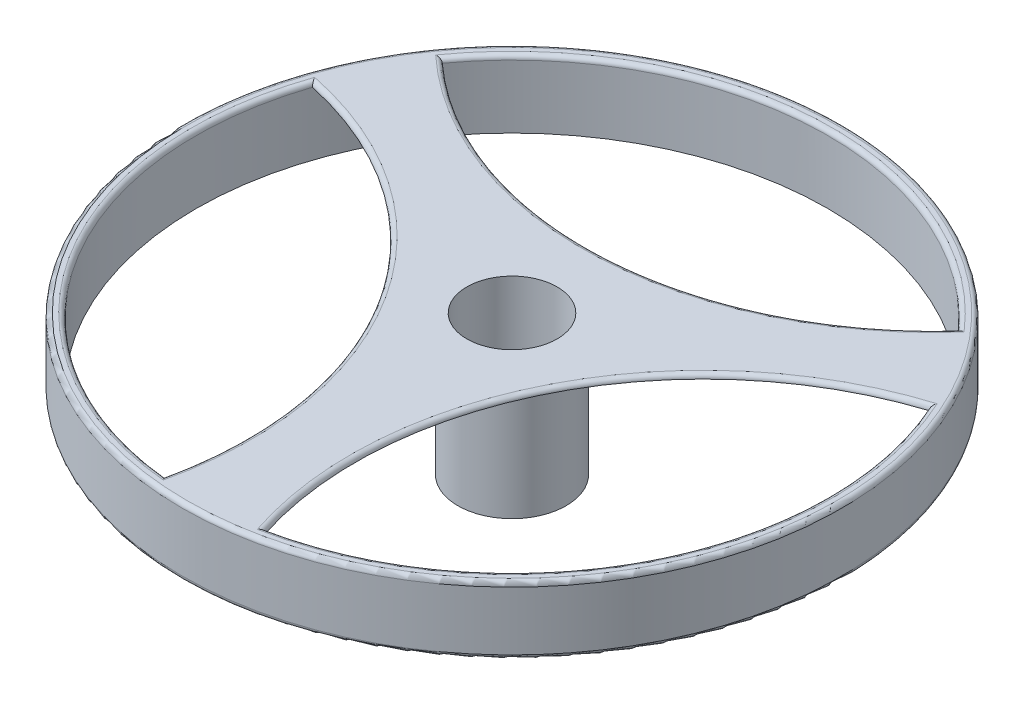
ISO-10303-21;
HEADER;
FILE_DESCRIPTION(('STEP AP214'),'2;1');
FILE_NAME('part.step','',(''),(''),'','','');
FILE_SCHEMA(('AUTOMOTIVE_DESIGN { 1 0 10303 214 1 1 1 1 }'));
ENDSEC;
DATA;
#1=APPLICATION_CONTEXT('core data for automotive mechanical design processes');
#2=APPLICATION_PROTOCOL_DEFINITION('international standard','automotive_design',2000,#1);
#3=PRODUCT_CONTEXT('',#1,'mechanical');
#4=PRODUCT('Part','Part','',(#3));
#5=PRODUCT_RELATED_PRODUCT_CATEGORY('part','',(#4));
#6=PRODUCT_DEFINITION_FORMATION('','',#4);
#7=PRODUCT_DEFINITION_CONTEXT('part definition',#1,'design');
#8=PRODUCT_DEFINITION('design','',#6,#7);
#9=PRODUCT_DEFINITION_SHAPE('','',#8);
#10=(LENGTH_UNIT() NAMED_UNIT(*) SI_UNIT(.MILLI.,.METRE.));
#11=(NAMED_UNIT(*) PLANE_ANGLE_UNIT() SI_UNIT($,.RADIAN.));
#12=(NAMED_UNIT(*) SI_UNIT($,.STERADIAN.) SOLID_ANGLE_UNIT());
#13=UNCERTAINTY_MEASURE_WITH_UNIT(LENGTH_MEASURE(1.E-05),#10,'distance_accuracy_value','');
#14=(GEOMETRIC_REPRESENTATION_CONTEXT(3) GLOBAL_UNCERTAINTY_ASSIGNED_CONTEXT((#13)) GLOBAL_UNIT_ASSIGNED_CONTEXT((#10,
#11,#12)) REPRESENTATION_CONTEXT('',''));
#15=CARTESIAN_POINT('',(0.,0.,0.));
#16=DIRECTION('',(0.,0.,1.));
#17=DIRECTION('',(1.,0.,0.));
#18=AXIS2_PLACEMENT_3D('',#15,#16,#17);
#19=CARTESIAN_POINT('',(0.,1.4,0.));
#20=DIRECTION('',(0.,-1.,0.));
#21=DIRECTION('',(0.,0.,-1.));
#22=AXIS2_PLACEMENT_3D('',#19,#20,#21);
#23=PLANE('',#22);
#24=CARTESIAN_POINT('',(8.7490481961673,1.4,4.505617403492));
#25=DIRECTION('',(0.,-1.,0.));
#26=DIRECTION('',(0.,0.,-1.));
#27=AXIS2_PLACEMENT_3D('',#24,#25,#26);
#28=CIRCLE('',#27,7.71814199906985);
#29=CARTESIAN_POINT('',(6.39577105395077,1.4,-2.84501539986086));
#30=VERTEX_POINT('',#29);
#31=CARTESIAN_POINT('',(1.39841539281421,1.4,6.85889454570781));
#32=VERTEX_POINT('',#31);
#33=EDGE_CURVE('E249',#30,#32,#28,.F.);
#34=ORIENTED_EDGE('',*,*,#33,.T.);
#35=CARTESIAN_POINT('',(0.,1.4,0.));
#36=DIRECTION('',(0.,-1.,0.));
#37=DIRECTION('',(0.,0.,-1.));
#38=AXIS2_PLACEMENT_3D('',#35,#36,#37);
#39=CIRCLE('',#38,7.);
#40=CARTESIAN_POINT('',(-0.734029916537966,1.4,6.96140790944097));
#41=VERTEX_POINT('',#40);
#42=EDGE_CURVE('E120',#32,#41,#39,.T.);
#43=ORIENTED_EDGE('',*,*,#42,.T.);
#44=CARTESIAN_POINT('',(-8.27650322924103,1.4,5.32408929506927));
#45=DIRECTION('',(0.,-1.,0.));
#46=DIRECTION('',(0.,0.,-1.));
#47=AXIS2_PLACEMENT_3D('',#44,#45,#46);
#48=CIRCLE('',#47,7.71814199906985);
#49=CARTESIAN_POINT('',(-6.63918461486858,1.4,-2.21838401763363));
#50=VERTEX_POINT('',#49);
#51=EDGE_CURVE('E109',#41,#50,#48,.F.);
#52=ORIENTED_EDGE('',*,*,#51,.T.);
#53=CARTESIAN_POINT('',(-5.6617411374128,1.4,-4.11639250958016));
#54=VERTEX_POINT('',#53);
#55=EDGE_CURVE('E104',#50,#54,#39,.T.);
#56=ORIENTED_EDGE('',*,*,#55,.T.);
#57=CARTESIAN_POINT('',(-0.472544966926212,1.4,-9.8297066985613));
#58=DIRECTION('',(0.,-1.,0.));
#59=DIRECTION('',(0.,0.,-1.));
#60=AXIS2_PLACEMENT_3D('',#57,#58,#59);
#61=CIRCLE('',#60,7.71814199906985);
#62=CARTESIAN_POINT('',(5.24076922205442,1.4,-4.64051052807416));
#63=VERTEX_POINT('',#62);
#64=EDGE_CURVE('E99',#54,#63,#61,.F.);
#65=ORIENTED_EDGE('',*,*,#64,.T.);
#66=EDGE_CURVE('E102',#63,#30,#39,.T.);
#67=ORIENTED_EDGE('',*,*,#66,.T.);
#68=EDGE_LOOP('',(#34,#43,#52,#56,#65,#67));
#69=FACE_BOUND('',#68,.T.);
#70=CARTESIAN_POINT('',(0.,1.4,0.));
#71=DIRECTION('',(0.,-1.,0.));
#72=DIRECTION('',(0.,0.,-1.));
#73=AXIS2_PLACEMENT_3D('',#70,#71,#72);
#74=CIRCLE('',#73,1.2);
#75=CARTESIAN_POINT('',(0.,1.4,-1.2));
#76=VERTEX_POINT('',#75);
#77=EDGE_CURVE('E253',#76,#76,#74,.T.);
#78=ORIENTED_EDGE('',*,*,#77,.F.);
#79=EDGE_LOOP('',(#78));
#80=FACE_BOUND('',#79,.T.);
#81=ADVANCED_FACE('F37',(#69,#80),#23,.T.);
#82=CARTESIAN_POINT('',(0.,0.,0.));
#83=DIRECTION('',(0.,1.,0.));
#84=DIRECTION('',(0.,0.,1.));
#85=AXIS2_PLACEMENT_3D('',#82,#83,#84);
#86=CYLINDRICAL_SURFACE('',#85,1.);
#87=CARTESIAN_POINT('',(0.,1.5,0.));
#88=DIRECTION('',(0.,1.,0.));
#89=DIRECTION('',(0.,0.,1.));
#90=AXIS2_PLACEMENT_3D('',#87,#88,#89);
#91=CIRCLE('',#90,1.);
#92=CARTESIAN_POINT('',(0.,1.5,1.));
#93=VERTEX_POINT('',#92);
#94=EDGE_CURVE('E136',#93,#93,#91,.T.);
#95=ORIENTED_EDGE('',*,*,#94,.T.);
#96=EDGE_LOOP('',(#95));
#97=FACE_BOUND('',#96,.T.);
#98=CARTESIAN_POINT('',(0.,-1.6,0.));
#99=DIRECTION('',(0.,-1.,0.));
#100=DIRECTION('',(0.,0.,-1.));
#101=AXIS2_PLACEMENT_3D('',#98,#99,#100);
#102=CIRCLE('',#101,1.);
#103=CARTESIAN_POINT('',(0.,-1.6,-1.));
#104=VERTEX_POINT('',#103);
#105=EDGE_CURVE('E257',#104,#104,#102,.T.);
#106=ORIENTED_EDGE('',*,*,#105,.T.);
#107=EDGE_LOOP('',(#106));
#108=FACE_BOUND('',#107,.T.);
#109=ADVANCED_FACE('F216',(#97,#108),#86,.F.);
#110=CARTESIAN_POINT('',(0.,1.5,0.));
#111=DIRECTION('',(0.,-1.,0.));
#112=DIRECTION('',(0.,0.,-1.));
#113=AXIS2_PLACEMENT_3D('',#110,#111,#112);
#114=CYLINDRICAL_SURFACE('',#113,7.3);
#115=CARTESIAN_POINT('',(0.,0.1,0.));
#116=DIRECTION('',(0.,1.,0.));
#117=DIRECTION('',(0.,0.,1.));
#118=AXIS2_PLACEMENT_3D('',#115,#116,#117);
#119=CIRCLE('',#118,7.3);
#120=CARTESIAN_POINT('',(0.,0.1,7.3));
#121=VERTEX_POINT('',#120);
#122=EDGE_CURVE('E51',#121,#121,#119,.T.);
#123=ORIENTED_EDGE('',*,*,#122,.T.);
#124=EDGE_LOOP('',(#123));
#125=FACE_BOUND('',#124,.T.);
#126=CARTESIAN_POINT('',(0.,1.4,0.));
#127=DIRECTION('',(0.,1.,0.));
#128=DIRECTION('',(0.,0.,1.));
#129=AXIS2_PLACEMENT_3D('',#126,#127,#128);
#130=CIRCLE('',#129,7.3);
#131=CARTESIAN_POINT('',(0.,1.4,7.3));
#132=VERTEX_POINT('',#131);
#133=EDGE_CURVE('E156',#132,#132,#130,.F.);
#134=ORIENTED_EDGE('',*,*,#133,.T.);
#135=EDGE_LOOP('',(#134));
#136=FACE_BOUND('',#135,.T.);
#137=ADVANCED_FACE('F221',(#125,#136),#114,.T.);
#138=CARTESIAN_POINT('',(0.,1.5,0.));
#139=DIRECTION('',(0.,1.,0.));
#140=DIRECTION('',(0.,0.,1.));
#141=AXIS2_PLACEMENT_3D('',#138,#139,#140);
#142=PLANE('',#141);
#143=CARTESIAN_POINT('',(-8.27650322924103,1.5,5.32408929506927));
#144=DIRECTION('',(0.,1.,0.));
#145=DIRECTION('',(0.,0.,1.));
#146=AXIS2_PLACEMENT_3D('',#143,#144,#145);
#147=CIRCLE('',#146,7.81814199906985);
#148=CARTESIAN_POINT('',(-6.70522037985575,1.5,-2.33452771617027));
#149=VERTEX_POINT('',#148);
#150=CARTESIAN_POINT('',(-0.655719657964701,1.5,7.069655700963));
#151=VERTEX_POINT('',#150);
#152=EDGE_CURVE('E58',#149,#151,#147,.F.);
#153=ORIENTED_EDGE('',*,*,#152,.T.);
#154=CARTESIAN_POINT('',(0.,1.5,0.));
#155=DIRECTION('',(0.,1.,0.));
#156=DIRECTION('',(0.,0.,1.));
#157=AXIS2_PLACEMENT_3D('',#154,#155,#156);
#158=CIRCLE('',#157,7.1);
#159=EDGE_CURVE('E154',#151,#149,#158,.F.);
#160=ORIENTED_EDGE('',*,*,#159,.T.);
#161=EDGE_LOOP('',(#153,#160));
#162=FACE_BOUND('',#161,.T.);
#163=CARTESIAN_POINT('',(8.7490481961673,1.5,4.505617403492));
#164=DIRECTION('',(0.,1.,0.));
#165=DIRECTION('',(0.,0.,1.));
#166=AXIS2_PLACEMENT_3D('',#163,#164,#165);
#167=CIRCLE('',#166,7.81814199906985);
#168=CARTESIAN_POINT('',(1.33084988188559,1.5,6.97415504501335));
#169=VERTEX_POINT('',#168);
#170=CARTESIAN_POINT('',(6.45036126202578,1.5,-2.96695796892326));
#171=VERTEX_POINT('',#170);
#172=EDGE_CURVE('E148',#169,#171,#167,.F.);
#173=ORIENTED_EDGE('',*,*,#172,.T.);
#174=CARTESIAN_POINT('',(0.,1.5,0.));
#175=DIRECTION('',(0.,1.,0.));
#176=DIRECTION('',(0.,0.,1.));
#177=AXIS2_PLACEMENT_3D('',#174,#175,#176);
#178=CIRCLE('',#177,7.1);
#179=EDGE_CURVE('E150',#171,#169,#178,.F.);
#180=ORIENTED_EDGE('',*,*,#179,.T.);
#181=EDGE_LOOP('',(#173,#180));
#182=FACE_BOUND('',#181,.T.);
#183=CARTESIAN_POINT('',(-0.472544966926212,1.5,-9.8297066985613));
#184=DIRECTION('',(0.,1.,0.));
#185=DIRECTION('',(0.,0.,1.));
#186=AXIS2_PLACEMENT_3D('',#183,#184,#185);
#187=CIRCLE('',#186,7.81814199906985);
#188=CARTESIAN_POINT('',(5.37437049797021,1.5,-4.63962732884306));
#189=VERTEX_POINT('',#188);
#190=CARTESIAN_POINT('',(-5.79464160406107,1.5,-4.1026977320398));
#191=VERTEX_POINT('',#190);
#192=EDGE_CURVE('E124',#189,#191,#187,.F.);
#193=ORIENTED_EDGE('',*,*,#192,.T.);
#194=CARTESIAN_POINT('',(0.,1.5,0.));
#195=DIRECTION('',(0.,1.,0.));
#196=DIRECTION('',(0.,0.,1.));
#197=AXIS2_PLACEMENT_3D('',#194,#195,#196);
#198=CIRCLE('',#197,7.1);
#199=EDGE_CURVE('E146',#191,#189,#198,.F.);
#200=ORIENTED_EDGE('',*,*,#199,.T.);
#201=EDGE_LOOP('',(#193,#200));
#202=FACE_BOUND('',#201,.T.);
#203=CARTESIAN_POINT('',(0.,1.5,0.));
#204=DIRECTION('',(0.,1.,0.));
#205=DIRECTION('',(0.,0.,1.));
#206=AXIS2_PLACEMENT_3D('',#203,#204,#205);
#207=CIRCLE('',#206,7.2);
#208=CARTESIAN_POINT('',(0.,1.5,7.2));
#209=VERTEX_POINT('',#208);
#210=EDGE_CURVE('E142',#209,#209,#207,.T.);
#211=ORIENTED_EDGE('',*,*,#210,.T.);
#212=EDGE_LOOP('',(#211));
#213=FACE_BOUND('',#212,.T.);
#214=ORIENTED_EDGE('',*,*,#94,.F.);
#215=EDGE_LOOP('',(#214));
#216=FACE_BOUND('',#215,.T.);
#217=ADVANCED_FACE('F231',(#162,#182,#202,#213,#216),#142,.T.);
#218=CARTESIAN_POINT('',(0.,0.,0.));
#219=DIRECTION('',(0.,1.,0.));
#220=DIRECTION('',(0.,0.,1.));
#221=AXIS2_PLACEMENT_3D('',#218,#219,#220);
#222=PLANE('',#221);
#223=CARTESIAN_POINT('',(0.,0.,0.));
#224=DIRECTION('',(0.,1.,0.));
#225=DIRECTION('',(0.,0.,1.));
#226=AXIS2_PLACEMENT_3D('',#223,#224,#225);
#227=CIRCLE('',#226,7.2);
#228=CARTESIAN_POINT('',(0.,0.,7.2));
#229=VERTEX_POINT('',#228);
#230=EDGE_CURVE('E11',#229,#229,#227,.F.);
#231=ORIENTED_EDGE('',*,*,#230,.T.);
#232=EDGE_LOOP('',(#231));
#233=FACE_BOUND('',#232,.T.);
#234=CARTESIAN_POINT('',(0.,0.,0.));
#235=DIRECTION('',(0.,1.,0.));
#236=DIRECTION('',(0.,0.,1.));
#237=AXIS2_PLACEMENT_3D('',#234,#235,#236);
#238=CIRCLE('',#237,7.);
#239=CARTESIAN_POINT('',(0.,0.,7.));
#240=VERTEX_POINT('',#239);
#241=EDGE_CURVE('E131',#240,#240,#238,.T.);
#242=ORIENTED_EDGE('',*,*,#241,.T.);
#243=EDGE_LOOP('',(#242));
#244=FACE_BOUND('',#243,.T.);
#245=ADVANCED_FACE('F230',(#233,#244),#222,.F.);
#246=CARTESIAN_POINT('',(0.,0.,0.));
#247=DIRECTION('',(0.,1.,0.));
#248=DIRECTION('',(0.,0.,1.));
#249=AXIS2_PLACEMENT_3D('',#246,#247,#248);
#250=CYLINDRICAL_SURFACE('',#249,7.);
#251=ORIENTED_EDGE('',*,*,#55,.F.);
#252=CARTESIAN_POINT('',(0.,1.4,0.));
#253=DIRECTION('',(0.,1.,0.));
#254=DIRECTION('',(0.,0.,1.));
#255=AXIS2_PLACEMENT_3D('',#252,#253,#254);
#256=CIRCLE('',#255,7.);
#257=EDGE_CURVE('E133',#50,#41,#256,.T.);
#258=ORIENTED_EDGE('',*,*,#257,.T.);
#259=ORIENTED_EDGE('',*,*,#42,.F.);
#260=CARTESIAN_POINT('',(0.,1.4,0.));
#261=DIRECTION('',(0.,1.,0.));
#262=DIRECTION('',(0.,0.,1.));
#263=AXIS2_PLACEMENT_3D('',#260,#261,#262);
#264=CIRCLE('',#263,7.);
#265=EDGE_CURVE('E119',#32,#30,#264,.T.);
#266=ORIENTED_EDGE('',*,*,#265,.T.);
#267=ORIENTED_EDGE('',*,*,#66,.F.);
#268=CARTESIAN_POINT('',(0.,1.4,0.));
#269=DIRECTION('',(0.,1.,0.));
#270=DIRECTION('',(0.,0.,1.));
#271=AXIS2_PLACEMENT_3D('',#268,#269,#270);
#272=CIRCLE('',#271,7.);
#273=EDGE_CURVE('E116',#63,#54,#272,.T.);
#274=ORIENTED_EDGE('',*,*,#273,.T.);
#275=EDGE_LOOP('',(#251,#258,#259,#266,#267,#274));
#276=FACE_BOUND('',#275,.T.);
#277=ORIENTED_EDGE('',*,*,#241,.F.);
#278=EDGE_LOOP('',(#277));
#279=FACE_BOUND('',#278,.T.);
#280=ADVANCED_FACE('F113',(#276,#279),#250,.F.);
#281=CARTESIAN_POINT('',(0.,-1.6,0.));
#282=DIRECTION('',(0.,-1.,0.));
#283=DIRECTION('',(0.,0.,-1.));
#284=AXIS2_PLACEMENT_3D('',#281,#282,#283);
#285=PLANE('',#284);
#286=CARTESIAN_POINT('',(0.,-1.6,0.));
#287=DIRECTION('',(0.,-1.,0.));
#288=DIRECTION('',(0.,0.,-1.));
#289=AXIS2_PLACEMENT_3D('',#286,#287,#288);
#290=CIRCLE('',#289,1.2);
#291=CARTESIAN_POINT('',(0.,-1.6,-1.2));
#292=VERTEX_POINT('',#291);
#293=EDGE_CURVE('E256',#292,#292,#290,.T.);
#294=ORIENTED_EDGE('',*,*,#293,.T.);
#295=EDGE_LOOP('',(#294));
#296=FACE_BOUND('',#295,.T.);
#297=ORIENTED_EDGE('',*,*,#105,.F.);
#298=EDGE_LOOP('',(#297));
#299=FACE_BOUND('',#298,.T.);
#300=ADVANCED_FACE('F229',(#296,#299),#285,.T.);
#301=CARTESIAN_POINT('',(0.,-1.6,0.));
#302=DIRECTION('',(0.,1.,0.));
#303=DIRECTION('',(0.,0.,1.));
#304=AXIS2_PLACEMENT_3D('',#301,#302,#303);
#305=CYLINDRICAL_SURFACE('',#304,1.2);
#306=ORIENTED_EDGE('',*,*,#293,.F.);
#307=EDGE_LOOP('',(#306));
#308=FACE_BOUND('',#307,.T.);
#309=ORIENTED_EDGE('',*,*,#77,.T.);
#310=EDGE_LOOP('',(#309));
#311=FACE_BOUND('',#310,.T.);
#312=ADVANCED_FACE('F180',(#308,#311),#305,.T.);
#313=CARTESIAN_POINT('',(-8.27650322924103,1.4,5.32408929506927));
#314=DIRECTION('',(0.,1.,0.));
#315=DIRECTION('',(0.,0.,1.));
#316=AXIS2_PLACEMENT_3D('',#313,#314,#315);
#317=TOROIDAL_SURFACE('',#316,7.81814199906985,0.1);
#318=CARTESIAN_POINT('',(-0.734029916537966,1.4,6.96140790944097));
#319=CARTESIAN_POINT('',(-0.734035805507698,1.40463053314781,6.96139975681462));
#320=CARTESIAN_POINT('',(-0.733777213389451,1.40925097168651,6.96175743483708));
#321=CARTESIAN_POINT('',(-0.732781692029903,1.41830394607141,6.96313437289628));
#322=CARTESIAN_POINT('',(-0.732048464343124,1.422737655555,6.9641485133585));
#323=CARTESIAN_POINT('',(-0.730155083628527,1.43131510764904,6.96676721064232));
#324=CARTESIAN_POINT('',(-0.728995906530069,1.43545948753824,6.96837041780185));
#325=CARTESIAN_POINT('',(-0.726317307842241,1.4433995617776,6.97207493382507));
#326=CARTESIAN_POINT('',(-0.724797175319223,1.4471945472303,6.9741772256785));
#327=CARTESIAN_POINT('',(-0.72086347634794,1.45568350886513,6.9796171596112));
#328=CARTESIAN_POINT('',(-0.718325277814005,1.46020933762823,6.98312707773416));
#329=CARTESIAN_POINT('',(-0.712853366509015,1.46850024181652,6.99069331304142));
#330=CARTESIAN_POINT('',(-0.709918957263544,1.47226394775385,6.99475059238747));
#331=CARTESIAN_POINT('',(-0.702796592698557,1.48011395067078,7.00459761696339));
#332=CARTESIAN_POINT('',(-0.698505332002009,1.48392705363916,7.01052995892078));
#333=CARTESIAN_POINT('',(-0.689620626594907,1.49032065238917,7.02281105168564));
#334=CARTESIAN_POINT('',(-0.685026961129807,1.4929002360953,7.029160106682));
#335=CARTESIAN_POINT('',(-0.676513694248512,1.49652204862426,7.04092525899367));
#336=CARTESIAN_POINT('',(-0.672621601246672,1.49775742603372,7.04630357215429));
#337=CARTESIAN_POINT('',(-0.664785303869147,1.49945170680195,7.05713121768677));
#338=CARTESIAN_POINT('',(-0.660841215609092,1.49991211613227,7.06258039153196));
#339=CARTESIAN_POINT('',(-0.656504924415274,1.49999619082466,7.0685708867098));
#340=CARTESIAN_POINT('',(-0.656112274042096,1.49999999758367,7.06911332000601));
#341=CARTESIAN_POINT('',(-0.655719657964701,1.5,7.069655700963));
#342=B_SPLINE_CURVE_WITH_KNOTS('',3,(#318,#319,#320,#321,#322,#323,#324,#325,#326,#327,#328,
#329,#330,#331,#332,#333,#334,#335,#336,#337,#338,#339,#340,#341),.UNSPECIFIED.,.F.,.F.,(4,2,2,
2,2,2,2,2,2,2,2,4),(0.,0.0138546088474856,0.027602450263886,0.0413189872455591,
0.0550627675880559,0.0737539637565457,0.0924784544891803,0.117113543402878,0.141766819669725,
0.161982375803211,0.182158602122732,0.184167482379803),.UNSPECIFIED.);
#343=EDGE_CURVE('E161',#151,#41,#342,.F.);
#344=ORIENTED_EDGE('',*,*,#343,.F.);
#345=ORIENTED_EDGE('',*,*,#152,.F.);
#346=CARTESIAN_POINT('',(-6.63918461486858,1.4,-2.21838401763363));
#347=CARTESIAN_POINT('',(-6.63917963771789,1.40463053314781,-2.2183752784545));
#348=CARTESIAN_POINT('',(-6.63939790485594,1.40925097168651,-2.21875889663423));
#349=CARTESIAN_POINT('',(-6.64023814619093,1.41830394607141,-2.22023572285798));
#350=CARTESIAN_POINT('',(-6.64085699634794,1.422737655555,-2.22132343982528));
#351=CARTESIAN_POINT('',(-6.64245495980509,1.43131510764904,-2.22413217241922));
#352=CARTESIAN_POINT('',(-6.64343324956165,1.43545948753824,-2.22585174035745));
#353=CARTESIAN_POINT('',(-6.64569373371466,1.4433995617776,-2.2298252201033));
#354=CARTESIAN_POINT('',(-6.64697652785789,1.4471945472303,-2.2320801864247));
#355=CARTESIAN_POINT('',(-6.65029584099204,1.45568350886513,-2.23791534101616));
#356=CARTESIAN_POINT('',(-6.65243745507213,1.46020933762823,-2.24168037304252));
#357=CARTESIAN_POINT('',(-6.65705391460081,1.46850024181652,-2.24979690133204));
#358=CARTESIAN_POINT('',(-6.65952934683794,1.47226394775385,-2.25414943031543));
#359=CARTESIAN_POINT('',(-6.6655369983754,1.48011395067078,-2.26471352483411));
#360=CARTESIAN_POINT('',(-6.66915614726598,1.48392705363916,-2.27107822127408));
#361=CARTESIAN_POINT('',(-6.67664808277139,1.49032065238917,-2.28425525174581));
#362=CARTESIAN_POINT('',(-6.68052105466681,1.4929002360953,-2.29106791278606));
#363=CARTESIAN_POINT('',(-6.6876974936591,1.49652204862426,-2.30369301655984));
#364=CARTESIAN_POINT('',(-6.69097798296753,1.49775742603372,-2.30946476068844));
#365=CARTESIAN_POINT('',(-6.69758198217171,1.49945170680195,-2.32108511605638));
#366=CARTESIAN_POINT('',(-6.70090539595311,1.49991211613227,-2.32693355590268));
#367=CARTESIAN_POINT('',(-6.70455879333616,1.49999619082466,-2.33336334138548));
#368=CARTESIAN_POINT('',(-6.70488960330026,1.49999999758367,-2.33394555523283));
#369=CARTESIAN_POINT('',(-6.70522037985575,1.5,-2.33452771617027));
#370=B_SPLINE_CURVE_WITH_KNOTS('',3,(#346,#347,#348,#349,#350,#351,#352,#353,#354,#355,#356,
#357,#358,#359,#360,#361,#362,#363,#364,#365,#366,#367,#368,#369),.UNSPECIFIED.,.F.,.F.,(4,2,2,
2,2,2,2,2,2,2,2,4),(0.,0.0138546088474856,0.0276024502638864,0.041318987245559,
0.0550627675880563,0.0737539637565469,0.0924784544891809,0.117113543402879,0.141766819669725,
0.161982375803211,0.182158602122732,0.184167482379803),.UNSPECIFIED.);
#371=EDGE_CURVE('E65',#50,#149,#370,.T.);
#372=ORIENTED_EDGE('',*,*,#371,.F.);
#373=ORIENTED_EDGE('',*,*,#51,.F.);
#374=EDGE_LOOP('',(#344,#345,#372,#373));
#375=FACE_BOUND('',#374,.T.);
#376=ADVANCED_FACE('F176',(#375),#317,.T.);
#377=CARTESIAN_POINT('',(0.,1.4,0.));
#378=DIRECTION('',(0.,1.,0.));
#379=DIRECTION('',(0.,0.,1.));
#380=AXIS2_PLACEMENT_3D('',#377,#378,#379);
#381=TOROIDAL_SURFACE('',#380,7.1,0.1);
#382=ORIENTED_EDGE('',*,*,#371,.T.);
#383=ORIENTED_EDGE('',*,*,#159,.F.);
#384=ORIENTED_EDGE('',*,*,#343,.T.);
#385=ORIENTED_EDGE('',*,*,#257,.F.);
#386=EDGE_LOOP('',(#382,#383,#384,#385));
#387=FACE_BOUND('',#386,.T.);
#388=ADVANCED_FACE('F173',(#387),#381,.T.);
#389=CARTESIAN_POINT('',(8.7490481961673,1.4,4.505617403492));
#390=DIRECTION('',(0.,1.,0.));
#391=DIRECTION('',(0.,0.,1.));
#392=AXIS2_PLACEMENT_3D('',#389,#390,#391);
#393=TOROIDAL_SURFACE('',#392,7.81814199906985,0.1);
#394=CARTESIAN_POINT('',(6.39577105395077,1.4,-2.84501539986086));
#395=CARTESIAN_POINT('',(6.39576693805411,1.40463053314781,-2.8450062235503));
#396=CARTESIAN_POINT('',(6.39594740024882,1.40925097168651,-2.84540900990515));
#397=CARTESIAN_POINT('',(6.39664210290774,1.41830394607141,-2.84695962572213));
#398=CARTESIAN_POINT('',(6.39715376046764,1.422737655555,-2.84810168975675));
#399=CARTESIAN_POINT('',(6.39847492848295,1.43131510764904,-2.85105075419653));
#400=CARTESIAN_POINT('',(6.3992837580614,1.43545948753824,-2.85285623459105));
#401=CARTESIAN_POINT('',(6.40115266370233,1.44339956177759,-2.85702822711287));
#402=CARTESIAN_POINT('',(6.40221323559206,1.4471945472303,-2.85939584642163));
#403=CARTESIAN_POINT('',(6.40495750708704,1.45568350886513,-2.86552249662795));
#404=CARTESIAN_POINT('',(6.40672808607976,1.46020933762823,-2.86947560009967));
#405=CARTESIAN_POINT('',(6.41054468241436,1.46850024181652,-2.87799753195067));
#406=CARTESIAN_POINT('',(6.41259118477556,1.47226394775385,-2.88256744457538));
#407=CARTESIAN_POINT('',(6.4175577759275,1.48011395067078,-2.89365910551163));
#408=CARTESIAN_POINT('',(6.42054970441826,1.48392705363916,-2.9003416172678));
#409=CARTESIAN_POINT('',(6.42674309003532,1.49032065238917,-2.91417654423792));
#410=CARTESIAN_POINT('',(6.42994470021964,1.4929002360953,-2.92132930272536));
#411=CARTESIAN_POINT('',(6.43587698756029,1.49652204862426,-2.9345845842696));
#412=CARTESIAN_POINT('',(6.43858869688597,1.49775742603372,-2.94064439226339));
#413=CARTESIAN_POINT('',(6.44404756429151,1.49945170680195,-2.95284464763018));
#414=CARTESIAN_POINT('',(6.44679464314106,1.49991211613227,-2.95898491518075));
#415=CARTESIAN_POINT('',(6.4498144185494,1.49999619082466,-2.96573550110172));
#416=CARTESIAN_POINT('',(6.45008785437719,1.49999999758367,-2.9663467629478));
#417=CARTESIAN_POINT('',(6.45036126202578,1.5,-2.96695796892326));
#418=B_SPLINE_CURVE_WITH_KNOTS('',3,(#394,#395,#396,#397,#398,#399,#400,#401,#402,#403,#404,
#405,#406,#407,#408,#409,#410,#411,#412,#413,#414,#415,#416,#417),.UNSPECIFIED.,.F.,.F.,(4,2,2,
2,2,2,2,2,2,2,2,4),(0.,0.0138546088474856,0.0276024502638859,0.0413189872455583,
0.0550627675880556,0.073753963756546,0.0924784544891802,0.117113543402878,0.141766819669725,
0.161982375803211,0.182158602122732,0.184167482379803),.UNSPECIFIED.);
#419=EDGE_CURVE('E128',#171,#30,#418,.F.);
#420=ORIENTED_EDGE('',*,*,#419,.F.);
#421=ORIENTED_EDGE('',*,*,#172,.F.);
#422=CARTESIAN_POINT('',(1.39841539281421,1.4,6.85889454570781));
#423=CARTESIAN_POINT('',(1.39842047259001,1.40463053314781,6.85888586577931));
#424=CARTESIAN_POINT('',(1.39819738307003,1.40925097168651,6.85926669975553));
#425=CARTESIAN_POINT('',(1.39733853471078,1.41830394607141,6.86073278320881));
#426=CARTESIAN_POINT('',(1.39670596926348,1.422737655555,6.86181258164957));
#427=CARTESIAN_POINT('',(1.39507251721326,1.43131510764904,6.86460082489475));
#428=CARTESIAN_POINT('',(1.3940724725735,1.43545948753824,6.86630783264531));
#429=CARTESIAN_POINT('',(1.39176158024868,1.4433995617776,6.8702522092196));
#430=CARTESIAN_POINT('',(1.39045011920128,1.4471945472303,6.87249062469616));
#431=CARTESIAN_POINT('',(1.38705638365714,1.45568350886513,6.87828281148918));
#432=CARTESIAN_POINT('',(1.38486657731629,1.46020933762823,6.88202001970082));
#433=CARTESIAN_POINT('',(1.38014568739138,1.46850024181652,6.89007625507296));
#434=CARTESIAN_POINT('',(1.37761400283962,1.47226394775385,6.89439630676735));
#435=CARTESIAN_POINT('',(1.37146905438719,1.48011395067079,6.90488113287522));
#436=CARTESIAN_POINT('',(1.36776664002809,1.48392705363916,6.91119775597452));
#437=CARTESIAN_POINT('',(1.36010096464583,1.49032065238917,6.92427447768159));
#438=CARTESIAN_POINT('',(1.35613751306532,1.4929002360953,6.9310349002513));
#439=CARTESIAN_POINT('',(1.34879207196795,1.49652204862426,6.94356243061422));
#440=CARTESIAN_POINT('',(1.34543383958266,1.49775742603372,6.94928928975645));
#441=CARTESIAN_POINT('',(1.3386723162351,1.49945170680195,6.96081869851782));
#442=CARTESIAN_POINT('',(1.33526912564641,1.49991211613227,6.96662107920295));
#443=CARTESIAN_POINT('',(1.33152746676895,1.49999619082466,6.97299990688819));
#444=CARTESIAN_POINT('',(1.33118865976876,1.49999999758367,6.9735775036446));
#445=CARTESIAN_POINT('',(1.33084988188559,1.5,6.97415504501335));
#446=B_SPLINE_CURVE_WITH_KNOTS('',3,(#422,#423,#424,#425,#426,#427,#428,#429,#430,#431,#432,
#433,#434,#435,#436,#437,#438,#439,#440,#441,#442,#443,#444,#445),.UNSPECIFIED.,.F.,.F.,(4,2,2,
2,2,2,2,2,2,2,2,4),(0.,0.0138546088474855,0.0276024502638862,0.0413189872455592,
0.0550627675880557,0.0737539637565463,0.0924784544891806,0.117113543402879,0.141766819669726,
0.161982375803212,0.182158602122733,0.184167482379803),.UNSPECIFIED.);
#447=EDGE_CURVE('E168',#32,#169,#446,.T.);
#448=ORIENTED_EDGE('',*,*,#447,.F.);
#449=ORIENTED_EDGE('',*,*,#33,.F.);
#450=EDGE_LOOP('',(#420,#421,#448,#449));
#451=FACE_BOUND('',#450,.T.);
#452=ADVANCED_FACE('F187',(#451),#393,.T.);
#453=CARTESIAN_POINT('',(0.,1.4,0.));
#454=DIRECTION('',(0.,1.,0.));
#455=DIRECTION('',(0.,0.,1.));
#456=AXIS2_PLACEMENT_3D('',#453,#454,#455);
#457=TOROIDAL_SURFACE('',#456,7.1,0.1);
#458=ORIENTED_EDGE('',*,*,#447,.T.);
#459=ORIENTED_EDGE('',*,*,#179,.F.);
#460=ORIENTED_EDGE('',*,*,#419,.T.);
#461=ORIENTED_EDGE('',*,*,#265,.F.);
#462=EDGE_LOOP('',(#458,#459,#460,#461));
#463=FACE_BOUND('',#462,.T.);
#464=ADVANCED_FACE('F182',(#463),#457,.T.);
#465=CARTESIAN_POINT('',(-0.472544966926212,1.4,-9.8297066985613));
#466=DIRECTION('',(0.,1.,0.));
#467=DIRECTION('',(0.,0.,1.));
#468=AXIS2_PLACEMENT_3D('',#465,#466,#467);
#469=TOROIDAL_SURFACE('',#468,7.81814199906985,0.1);
#470=CARTESIAN_POINT('',(-5.6617411374128,1.4,-4.11639250958016));
#471=CARTESIAN_POINT('',(-5.66173113254641,1.40463053314781,-4.11639353326437));
#472=CARTESIAN_POINT('',(-5.66217018685936,1.40925097168651,-4.11634842493199));
#473=CARTESIAN_POINT('',(-5.66386041087783,1.41830394607141,-4.1161747471742));
#474=CARTESIAN_POINT('',(-5.66510529612451,1.422737655555,-4.11604682360181));
#475=CARTESIAN_POINT('',(-5.66831984485442,1.43131510764904,-4.11571645644584));
#476=CARTESIAN_POINT('',(-5.67028785153133,1.43545948753824,-4.11551418321085));
#477=CARTESIAN_POINT('',(-5.67483535586008,1.4433995617776,-4.11504670671226));
#478=CARTESIAN_POINT('',(-5.67741606027283,1.4471945472303,-4.11478137925693));
#479=CARTESIAN_POINT('',(-5.68409403073909,1.45568350886513,-4.1140946629833));
#480=CARTESIAN_POINT('',(-5.68840280826575,1.46020933762823,-4.11365147763455));
#481=CARTESIAN_POINT('',(-5.69769131590535,1.46850024181652,-4.1126957810908));
#482=CARTESIAN_POINT('',(-5.70267222751201,1.47226394775385,-4.11218314781215));
#483=CARTESIAN_POINT('',(-5.71476118322894,1.48011395067078,-4.11093851145181));
#484=CARTESIAN_POINT('',(-5.72204437241625,1.48392705363916,-4.11018834165304));
#485=CARTESIAN_POINT('',(-5.73712246344041,1.49032065238917,-4.10863450744778));
#486=CARTESIAN_POINT('',(-5.74491773908983,1.4929002360953,-4.1078308039567));
#487=CARTESIAN_POINT('',(-5.75936329331177,1.49652204862426,-4.10634067472413));
#488=CARTESIAN_POINT('',(-5.76596709563929,1.49775742603372,-4.10565917989095));
#489=CARTESIAN_POINT('',(-5.77926226042236,1.49945170680195,-4.10428657005665));
#490=CARTESIAN_POINT('',(-5.78595342753196,1.49991211613227,-4.10359547635127));
#491=CARTESIAN_POINT('',(-5.79330949413413,1.49999619082466,-4.10283538560814));
#492=CARTESIAN_POINT('',(-5.79397558033509,1.49999999758367,-4.10276655705826));
#493=CARTESIAN_POINT('',(-5.79464160406107,1.5,-4.1026977320398));
#494=B_SPLINE_CURVE_WITH_KNOTS('',3,(#470,#471,#472,#473,#474,#475,#476,#477,#478,#479,#480,
#481,#482,#483,#484,#485,#486,#487,#488,#489,#490,#491,#492,#493),.UNSPECIFIED.,.F.,.F.,(4,2,2,
2,2,2,2,2,2,2,2,4),(0.,0.0138546088474854,0.0276024502638859,0.0413189872455587,
0.0550627675880555,0.0737539637565467,0.0924784544891806,0.117113543402878,0.141766819669725,
0.161982375803212,0.182158602122734,0.184167482379804),.UNSPECIFIED.);
#495=EDGE_CURVE('E129',#191,#54,#494,.F.);
#496=ORIENTED_EDGE('',*,*,#495,.F.);
#497=ORIENTED_EDGE('',*,*,#192,.F.);
#498=CARTESIAN_POINT('',(5.24076922205442,1.4,-4.64051052807416));
#499=CARTESIAN_POINT('',(5.24075916512794,1.40463053314781,-4.64051058732479));
#500=CARTESIAN_POINT('',(5.24120052178597,1.40925097168651,-4.64050780312128));
#501=CARTESIAN_POINT('',(5.2428996114802,1.41830394607141,-4.64049706035081));
#502=CARTESIAN_POINT('',(5.24415102708452,1.422737655555,-4.64048914182427));
#503=CARTESIAN_POINT('',(5.24738244259188,1.43131510764904,-4.64046865247552));
#504=CARTESIAN_POINT('',(5.2493607769882,1.43545948753824,-4.64045609228784));
#505=CARTESIAN_POINT('',(5.25393215346604,1.4433995617776,-4.64042698911628));
#506=CARTESIAN_POINT('',(5.25652640865666,1.4471945472303,-4.64041043827144));
#507=CARTESIAN_POINT('',(5.26323945733495,1.45568350886513,-4.640367470473));
#508=CARTESIAN_POINT('',(5.26757087775589,1.46020933762823,-4.64033964665828));
#509=CARTESIAN_POINT('',(5.27690822720948,1.46850024181652,-4.6402793537409));
#510=CARTESIAN_POINT('',(5.28191534399837,1.47226394775385,-4.64024687645191));
#511=CARTESIAN_POINT('',(5.29406794398826,1.48011395067078,-4.64016760804109));
#512=CARTESIAN_POINT('',(5.30138950723794,1.48392705363916,-4.64011953470042));
#513=CARTESIAN_POINT('',(5.31654711812561,1.49032065238917,-4.64001922593576));
#514=CARTESIAN_POINT('',(5.32438354160155,1.4929002360953,-4.63996698746522));
#515=CARTESIAN_POINT('',(5.3389054216912,1.49652204862426,-4.63986941405436));
#516=CARTESIAN_POINT('',(5.34554414338492,1.49775742603372,-4.639824529068));
#517=CARTESIAN_POINT('',(5.35890966593665,1.49945170680195,-4.63973358246141));
#518=CARTESIAN_POINT('',(5.36563627030676,1.49991211613227,-4.63968752330025));
#519=CARTESIAN_POINT('',(5.37303132656727,1.49999619082466,-4.63963656550269));
#520=CARTESIAN_POINT('',(5.37370094353156,1.49999999758367,-4.63963194841176));
#521=CARTESIAN_POINT('',(5.37437049797021,1.5,-4.63962732884306));
#522=B_SPLINE_CURVE_WITH_KNOTS('',3,(#498,#499,#500,#501,#502,#503,#504,#505,#506,#507,#508,
#509,#510,#511,#512,#513,#514,#515,#516,#517,#518,#519,#520,#521),.UNSPECIFIED.,.F.,.F.,(4,2,2,
2,2,2,2,2,2,2,2,4),(0.,0.0138546088474855,0.0276024502638864,0.0413189872455593,
0.0550627675880559,0.0737539637565456,0.0924784544891805,0.117113543402879,0.141766819669726,
0.161982375803212,0.182158602122733,0.184167482379804),.UNSPECIFIED.);
#523=EDGE_CURVE('E41',#63,#189,#522,.T.);
#524=ORIENTED_EDGE('',*,*,#523,.F.);
#525=ORIENTED_EDGE('',*,*,#64,.F.);
#526=EDGE_LOOP('',(#496,#497,#524,#525));
#527=FACE_BOUND('',#526,.T.);
#528=ADVANCED_FACE('F123',(#527),#469,.T.);
#529=CARTESIAN_POINT('',(0.,1.4,0.));
#530=DIRECTION('',(0.,1.,0.));
#531=DIRECTION('',(0.,0.,1.));
#532=AXIS2_PLACEMENT_3D('',#529,#530,#531);
#533=TOROIDAL_SURFACE('',#532,7.1,0.1);
#534=ORIENTED_EDGE('',*,*,#523,.T.);
#535=ORIENTED_EDGE('',*,*,#199,.F.);
#536=ORIENTED_EDGE('',*,*,#495,.T.);
#537=ORIENTED_EDGE('',*,*,#273,.F.);
#538=EDGE_LOOP('',(#534,#535,#536,#537));
#539=FACE_BOUND('',#538,.T.);
#540=ADVANCED_FACE('F130',(#539),#533,.T.);
#541=CARTESIAN_POINT('',(0.,0.1,0.));
#542=DIRECTION('',(0.,1.,0.));
#543=DIRECTION('',(0.,0.,1.));
#544=AXIS2_PLACEMENT_3D('',#541,#542,#543);
#545=TOROIDAL_SURFACE('',#544,7.2,0.1);
#546=ORIENTED_EDGE('',*,*,#230,.F.);
#547=EDGE_LOOP('',(#546));
#548=FACE_BOUND('',#547,.T.);
#549=ORIENTED_EDGE('',*,*,#122,.F.);
#550=EDGE_LOOP('',(#549));
#551=FACE_BOUND('',#550,.T.);
#552=ADVANCED_FACE('F204',(#548,#551),#545,.T.);
#553=CARTESIAN_POINT('',(0.,1.4,0.));
#554=DIRECTION('',(0.,1.,0.));
#555=DIRECTION('',(0.,0.,1.));
#556=AXIS2_PLACEMENT_3D('',#553,#554,#555);
#557=TOROIDAL_SURFACE('',#556,7.2,0.1);
#558=ORIENTED_EDGE('',*,*,#133,.F.);
#559=EDGE_LOOP('',(#558));
#560=FACE_BOUND('',#559,.T.);
#561=ORIENTED_EDGE('',*,*,#210,.F.);
#562=EDGE_LOOP('',(#561));
#563=FACE_BOUND('',#562,.T.);
#564=ADVANCED_FACE('F39',(#560,#563),#557,.T.);
#565=CLOSED_SHELL('',(#81,#109,#137,#217,#245,#280,#300,#312,#376,#388,#452,#464,#528,#540,#552,#564));
#566=MANIFOLD_SOLID_BREP('B2',#565);
#567=ADVANCED_BREP_SHAPE_REPRESENTATION('',(#18,#566),#14);
#568=SHAPE_DEFINITION_REPRESENTATION(#9,#567);
ENDSEC;
END-ISO-10303-21;
